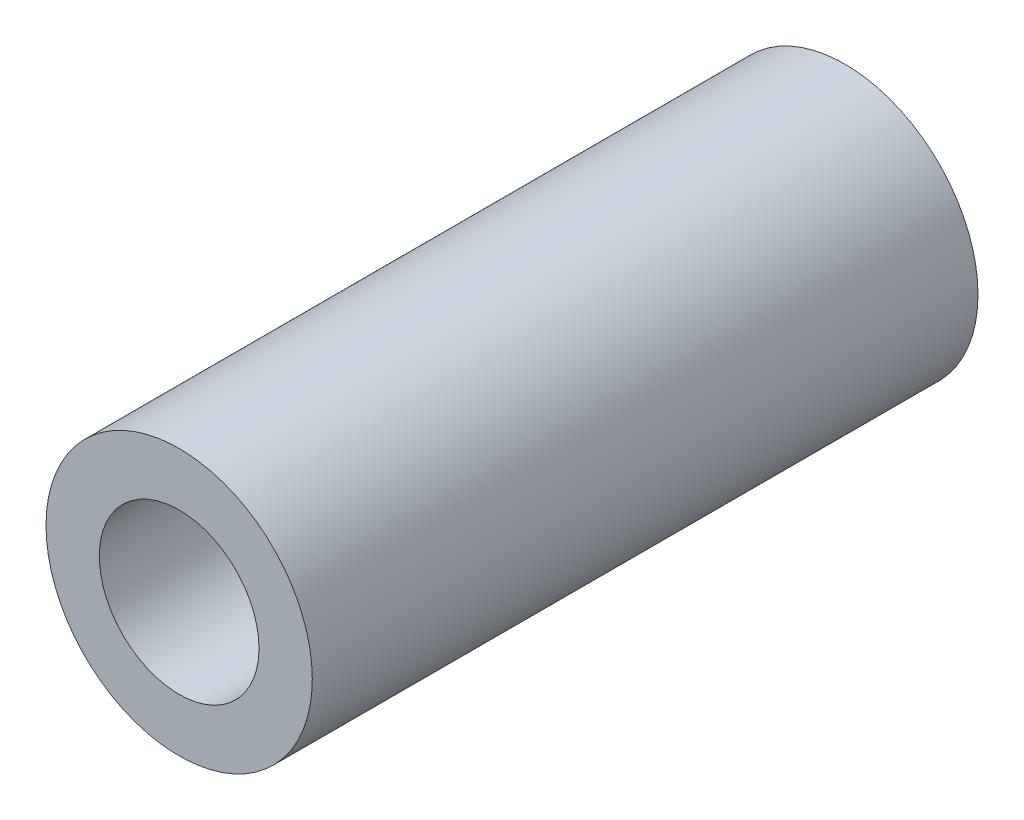
ISO-10303-21;
HEADER;
FILE_DESCRIPTION(('STEP AP214'),'2;1');
FILE_NAME('part.step','',(''),(''),'','','');
FILE_SCHEMA(('AUTOMOTIVE_DESIGN { 1 0 10303 214 1 1 1 1 }'));
ENDSEC;
DATA;
#1=APPLICATION_CONTEXT('core data for automotive mechanical design processes');
#2=APPLICATION_PROTOCOL_DEFINITION('international standard','automotive_design',2000,#1);
#3=PRODUCT_CONTEXT('',#1,'mechanical');
#4=PRODUCT('Part','Part','',(#3));
#5=PRODUCT_RELATED_PRODUCT_CATEGORY('part','',(#4));
#6=PRODUCT_DEFINITION_FORMATION('','',#4);
#7=PRODUCT_DEFINITION_CONTEXT('part definition',#1,'design');
#8=PRODUCT_DEFINITION('design','',#6,#7);
#9=PRODUCT_DEFINITION_SHAPE('','',#8);
#10=(LENGTH_UNIT() NAMED_UNIT(*) SI_UNIT(.MILLI.,.METRE.));
#11=(NAMED_UNIT(*) PLANE_ANGLE_UNIT() SI_UNIT($,.RADIAN.));
#12=(NAMED_UNIT(*) SI_UNIT($,.STERADIAN.) SOLID_ANGLE_UNIT());
#13=UNCERTAINTY_MEASURE_WITH_UNIT(LENGTH_MEASURE(1.E-05),#10,'distance_accuracy_value','');
#14=(GEOMETRIC_REPRESENTATION_CONTEXT(3) GLOBAL_UNCERTAINTY_ASSIGNED_CONTEXT((#13)) GLOBAL_UNIT_ASSIGNED_CONTEXT((#10,
#11,#12)) REPRESENTATION_CONTEXT('',''));
#15=CARTESIAN_POINT('',(0.,0.,0.));
#16=DIRECTION('',(0.,0.,1.));
#17=DIRECTION('',(1.,0.,0.));
#18=AXIS2_PLACEMENT_3D('',#15,#16,#17);
#19=CARTESIAN_POINT('',(0.,0.,25.));
#20=DIRECTION('',(0.,0.,1.));
#21=DIRECTION('',(1.,0.,0.));
#22=AXIS2_PLACEMENT_3D('',#19,#20,#21);
#23=PLANE('',#22);
#24=CARTESIAN_POINT('',(0.,0.,25.));
#25=DIRECTION('',(0.,0.,1.));
#26=DIRECTION('',(1.,0.,0.));
#27=AXIS2_PLACEMENT_3D('',#24,#25,#26);
#28=CIRCLE('',#27,5.);
#29=CARTESIAN_POINT('',(5.,0.,25.));
#30=VERTEX_POINT('',#29);
#31=EDGE_CURVE('E10',#30,#30,#28,.T.);
#32=ORIENTED_EDGE('',*,*,#31,.T.);
#33=EDGE_LOOP('',(#32));
#34=FACE_BOUND('',#33,.T.);
#35=CARTESIAN_POINT('',(0.,0.,25.));
#36=DIRECTION('',(0.,0.,1.));
#37=DIRECTION('',(1.,0.,0.));
#38=AXIS2_PLACEMENT_3D('',#35,#36,#37);
#39=CIRCLE('',#38,3.);
#40=CARTESIAN_POINT('',(3.,0.,25.));
#41=VERTEX_POINT('',#40);
#42=EDGE_CURVE('E42',#41,#41,#39,.T.);
#43=ORIENTED_EDGE('',*,*,#42,.F.);
#44=EDGE_LOOP('',(#43));
#45=FACE_BOUND('',#44,.T.);
#46=ADVANCED_FACE('F31',(#34,#45),#23,.T.);
#47=CARTESIAN_POINT('',(0.,0.,0.));
#48=DIRECTION('',(0.,0.,1.));
#49=DIRECTION('',(1.,0.,0.));
#50=AXIS2_PLACEMENT_3D('',#47,#48,#49);
#51=PLANE('',#50);
#52=CARTESIAN_POINT('',(0.,0.,0.));
#53=DIRECTION('',(0.,0.,1.));
#54=DIRECTION('',(1.,0.,0.));
#55=AXIS2_PLACEMENT_3D('',#52,#53,#54);
#56=CIRCLE('',#55,5.);
#57=CARTESIAN_POINT('',(5.,0.,0.));
#58=VERTEX_POINT('',#57);
#59=EDGE_CURVE('E35',#58,#58,#56,.T.);
#60=ORIENTED_EDGE('',*,*,#59,.F.);
#61=EDGE_LOOP('',(#60));
#62=FACE_BOUND('',#61,.T.);
#63=CARTESIAN_POINT('',(0.,0.,0.));
#64=DIRECTION('',(0.,0.,1.));
#65=DIRECTION('',(1.,0.,0.));
#66=AXIS2_PLACEMENT_3D('',#63,#64,#65);
#67=CIRCLE('',#66,3.);
#68=CARTESIAN_POINT('',(3.,0.,0.));
#69=VERTEX_POINT('',#68);
#70=EDGE_CURVE('E44',#69,#69,#67,.T.);
#71=ORIENTED_EDGE('',*,*,#70,.T.);
#72=EDGE_LOOP('',(#71));
#73=FACE_BOUND('',#72,.T.);
#74=ADVANCED_FACE('F54',(#62,#73),#51,.F.);
#75=CARTESIAN_POINT('',(0.,0.,25.));
#76=DIRECTION('',(0.,0.,-1.));
#77=DIRECTION('',(-1.,0.,0.));
#78=AXIS2_PLACEMENT_3D('',#75,#76,#77);
#79=CYLINDRICAL_SURFACE('',#78,5.);
#80=ORIENTED_EDGE('',*,*,#31,.F.);
#81=EDGE_LOOP('',(#80));
#82=FACE_BOUND('',#81,.T.);
#83=ORIENTED_EDGE('',*,*,#59,.T.);
#84=EDGE_LOOP('',(#83));
#85=FACE_BOUND('',#84,.T.);
#86=ADVANCED_FACE('F33',(#82,#85),#79,.T.);
#87=CARTESIAN_POINT('',(0.,0.,25.));
#88=DIRECTION('',(0.,0.,-1.));
#89=DIRECTION('',(-1.,0.,0.));
#90=AXIS2_PLACEMENT_3D('',#87,#88,#89);
#91=CYLINDRICAL_SURFACE('',#90,3.);
#92=ORIENTED_EDGE('',*,*,#42,.T.);
#93=EDGE_LOOP('',(#92));
#94=FACE_BOUND('',#93,.T.);
#95=ORIENTED_EDGE('',*,*,#70,.F.);
#96=EDGE_LOOP('',(#95));
#97=FACE_BOUND('',#96,.T.);
#98=ADVANCED_FACE('F50',(#94,#97),#91,.F.);
#99=CLOSED_SHELL('',(#46,#74,#86,#98));
#100=MANIFOLD_SOLID_BREP('B2',#99);
#101=ADVANCED_BREP_SHAPE_REPRESENTATION('',(#18,#100),#14);
#102=SHAPE_DEFINITION_REPRESENTATION(#9,#101);
ENDSEC;
END-ISO-10303-21;
